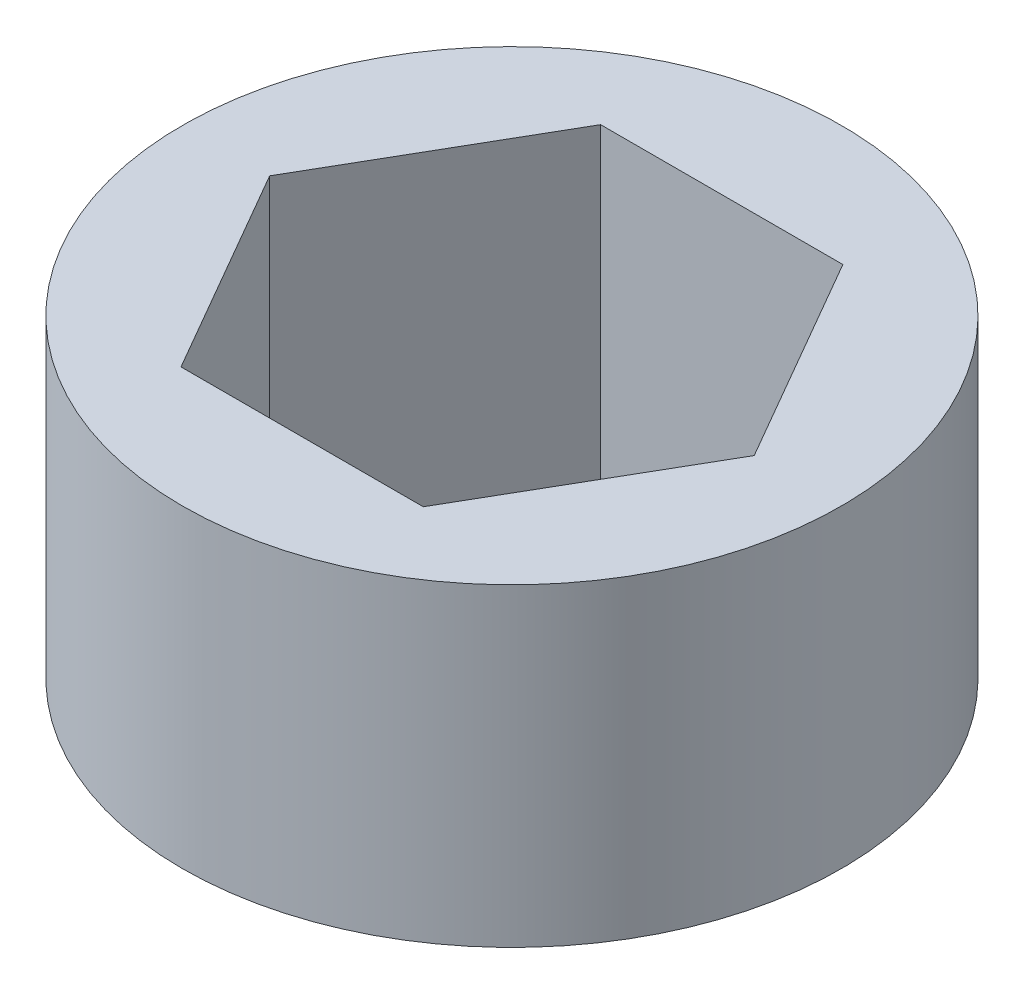
ISO-10303-21;
HEADER;
FILE_DESCRIPTION(('STEP AP214'),'2;1');
FILE_NAME('part.step','',(''),(''),'','','');
FILE_SCHEMA(('AUTOMOTIVE_DESIGN { 1 0 10303 214 1 1 1 1 }'));
ENDSEC;
DATA;
#1=APPLICATION_CONTEXT('core data for automotive mechanical design processes');
#2=APPLICATION_PROTOCOL_DEFINITION('international standard','automotive_design',2000,#1);
#3=PRODUCT_CONTEXT('',#1,'mechanical');
#4=PRODUCT('Part','Part','',(#3));
#5=PRODUCT_RELATED_PRODUCT_CATEGORY('part','',(#4));
#6=PRODUCT_DEFINITION_FORMATION('','',#4);
#7=PRODUCT_DEFINITION_CONTEXT('part definition',#1,'design');
#8=PRODUCT_DEFINITION('design','',#6,#7);
#9=PRODUCT_DEFINITION_SHAPE('','',#8);
#10=(LENGTH_UNIT() NAMED_UNIT(*) SI_UNIT(.MILLI.,.METRE.));
#11=(NAMED_UNIT(*) PLANE_ANGLE_UNIT() SI_UNIT($,.RADIAN.));
#12=(NAMED_UNIT(*) SI_UNIT($,.STERADIAN.) SOLID_ANGLE_UNIT());
#13=UNCERTAINTY_MEASURE_WITH_UNIT(LENGTH_MEASURE(1.E-05),#10,'distance_accuracy_value','');
#14=(GEOMETRIC_REPRESENTATION_CONTEXT(3) GLOBAL_UNCERTAINTY_ASSIGNED_CONTEXT((#13)) GLOBAL_UNIT_ASSIGNED_CONTEXT((#10,
#11,#12)) REPRESENTATION_CONTEXT('',''));
#15=CARTESIAN_POINT('',(0.,0.,0.));
#16=DIRECTION('',(0.,0.,1.));
#17=DIRECTION('',(1.,0.,0.));
#18=AXIS2_PLACEMENT_3D('',#15,#16,#17);
#19=CARTESIAN_POINT('',(0.,9.525,0.));
#20=DIRECTION('',(0.,1.,0.));
#21=DIRECTION('',(0.,0.,1.));
#22=AXIS2_PLACEMENT_3D('',#19,#20,#21);
#23=PLANE('',#22);
#24=CARTESIAN_POINT('',(0.,9.525,0.));
#25=DIRECTION('',(0.,1.,0.));
#26=DIRECTION('',(0.,0.,1.));
#27=AXIS2_PLACEMENT_3D('',#24,#25,#26);
#28=CIRCLE('',#27,9.9949);
#29=CARTESIAN_POINT('',(0.,9.525,9.9949));
#30=VERTEX_POINT('',#29);
#31=EDGE_CURVE('E11',#30,#30,#28,.T.);
#32=ORIENTED_EDGE('',*,*,#31,.T.);
#33=EDGE_LOOP('',(#32));
#34=FACE_BOUND('',#33,.T.);
#35=DIRECTION('',(-0.5,0.,-0.866025403784438));
#36=VECTOR('',#35,1.);
#37=CARTESIAN_POINT('',(7.34701311554567,9.525,0.));
#38=LINE('',#37,#36);
#39=CARTESIAN_POINT('',(7.34701311554567,9.525,0.));
#40=VERTEX_POINT('',#39);
#41=CARTESIAN_POINT('',(3.67350655777283,9.525,-6.3627));
#42=VERTEX_POINT('',#41);
#43=EDGE_CURVE('E95',#40,#42,#38,.T.);
#44=ORIENTED_EDGE('',*,*,#43,.F.);
#45=DIRECTION('',(0.5,0.,-0.866025403784439));
#46=VECTOR('',#45,1.);
#47=CARTESIAN_POINT('',(3.67350655777284,9.525,6.3627));
#48=LINE('',#47,#46);
#49=CARTESIAN_POINT('',(3.67350655777284,9.525,6.3627));
#50=VERTEX_POINT('',#49);
#51=EDGE_CURVE('E87',#50,#40,#48,.T.);
#52=ORIENTED_EDGE('',*,*,#51,.F.);
#53=DIRECTION('',(1.,0.,0.));
#54=VECTOR('',#53,1.);
#55=CARTESIAN_POINT('',(-3.67350655777283,9.525,6.3627));
#56=LINE('',#55,#54);
#57=CARTESIAN_POINT('',(-3.67350655777283,9.525,6.3627));
#58=VERTEX_POINT('',#57);
#59=EDGE_CURVE('E115',#58,#50,#56,.T.);
#60=ORIENTED_EDGE('',*,*,#59,.F.);
#61=DIRECTION('',(0.5,0.,0.866025403784438));
#62=VECTOR('',#61,1.);
#63=CARTESIAN_POINT('',(-7.34701311554566,9.525,0.));
#64=LINE('',#63,#62);
#65=CARTESIAN_POINT('',(-7.34701311554566,9.525,0.));
#66=VERTEX_POINT('',#65);
#67=EDGE_CURVE('E113',#66,#58,#64,.T.);
#68=ORIENTED_EDGE('',*,*,#67,.F.);
#69=DIRECTION('',(-0.5,0.,0.866025403784439));
#70=VECTOR('',#69,1.);
#71=CARTESIAN_POINT('',(-3.67350655777283,9.525,-6.3627));
#72=LINE('',#71,#70);
#73=CARTESIAN_POINT('',(-3.67350655777283,9.525,-6.3627));
#74=VERTEX_POINT('',#73);
#75=EDGE_CURVE('E109',#74,#66,#72,.T.);
#76=ORIENTED_EDGE('',*,*,#75,.F.);
#77=DIRECTION('',(-1.,0.,0.));
#78=VECTOR('',#77,1.);
#79=CARTESIAN_POINT('',(3.67350655777283,9.525,-6.3627));
#80=LINE('',#79,#78);
#81=EDGE_CURVE('E107',#42,#74,#80,.T.);
#82=ORIENTED_EDGE('',*,*,#81,.F.);
#83=EDGE_LOOP('',(#44,#52,#60,#68,#76,#82));
#84=FACE_BOUND('',#83,.T.);
#85=ADVANCED_FACE('F34',(#34,#84),#23,.T.);
#86=CARTESIAN_POINT('',(0.,0.,0.));
#87=DIRECTION('',(0.,1.,0.));
#88=DIRECTION('',(0.,0.,1.));
#89=AXIS2_PLACEMENT_3D('',#86,#87,#88);
#90=PLANE('',#89);
#91=CARTESIAN_POINT('',(0.,0.,0.));
#92=DIRECTION('',(0.,1.,0.));
#93=DIRECTION('',(0.,0.,1.));
#94=AXIS2_PLACEMENT_3D('',#91,#92,#93);
#95=CIRCLE('',#94,9.9949);
#96=CARTESIAN_POINT('',(0.,0.,9.9949));
#97=VERTEX_POINT('',#96);
#98=EDGE_CURVE('E38',#97,#97,#95,.T.);
#99=ORIENTED_EDGE('',*,*,#98,.F.);
#100=EDGE_LOOP('',(#99));
#101=FACE_BOUND('',#100,.T.);
#102=DIRECTION('',(0.5,0.,-0.866025403784439));
#103=VECTOR('',#102,1.);
#104=CARTESIAN_POINT('',(3.67350655777284,0.,6.3627));
#105=LINE('',#104,#103);
#106=CARTESIAN_POINT('',(3.67350655777284,0.,6.3627));
#107=VERTEX_POINT('',#106);
#108=CARTESIAN_POINT('',(7.34701311554567,0.,0.));
#109=VERTEX_POINT('',#108);
#110=EDGE_CURVE('E57',#107,#109,#105,.T.);
#111=ORIENTED_EDGE('',*,*,#110,.T.);
#112=DIRECTION('',(-0.5,0.,-0.866025403784438));
#113=VECTOR('',#112,1.);
#114=CARTESIAN_POINT('',(7.34701311554567,0.,0.));
#115=LINE('',#114,#113);
#116=CARTESIAN_POINT('',(3.67350655777283,0.,-6.3627));
#117=VERTEX_POINT('',#116);
#118=EDGE_CURVE('E102',#109,#117,#115,.T.);
#119=ORIENTED_EDGE('',*,*,#118,.T.);
#120=DIRECTION('',(-1.,0.,0.));
#121=VECTOR('',#120,1.);
#122=CARTESIAN_POINT('',(3.67350655777283,0.,-6.3627));
#123=LINE('',#122,#121);
#124=CARTESIAN_POINT('',(-3.67350655777283,0.,-6.3627));
#125=VERTEX_POINT('',#124);
#126=EDGE_CURVE('E119',#117,#125,#123,.T.);
#127=ORIENTED_EDGE('',*,*,#126,.T.);
#128=DIRECTION('',(-0.5,0.,0.866025403784439));
#129=VECTOR('',#128,1.);
#130=CARTESIAN_POINT('',(-3.67350655777283,0.,-6.3627));
#131=LINE('',#130,#129);
#132=CARTESIAN_POINT('',(-7.34701311554566,0.,0.));
#133=VERTEX_POINT('',#132);
#134=EDGE_CURVE('E122',#125,#133,#131,.T.);
#135=ORIENTED_EDGE('',*,*,#134,.T.);
#136=DIRECTION('',(0.5,0.,0.866025403784438));
#137=VECTOR('',#136,1.);
#138=CARTESIAN_POINT('',(-7.34701311554566,0.,0.));
#139=LINE('',#138,#137);
#140=CARTESIAN_POINT('',(-3.67350655777283,0.,6.3627));
#141=VERTEX_POINT('',#140);
#142=EDGE_CURVE('E125',#133,#141,#139,.T.);
#143=ORIENTED_EDGE('',*,*,#142,.T.);
#144=DIRECTION('',(1.,0.,0.));
#145=VECTOR('',#144,1.);
#146=CARTESIAN_POINT('',(-3.67350655777283,0.,6.3627));
#147=LINE('',#146,#145);
#148=EDGE_CURVE('E96',#141,#107,#147,.T.);
#149=ORIENTED_EDGE('',*,*,#148,.T.);
#150=EDGE_LOOP('',(#111,#119,#127,#135,#143,#149));
#151=FACE_BOUND('',#150,.T.);
#152=ADVANCED_FACE('F142',(#101,#151),#90,.F.);
#153=CARTESIAN_POINT('',(0.,9.525,0.));
#154=DIRECTION('',(0.,-1.,0.));
#155=DIRECTION('',(0.,0.,-1.));
#156=AXIS2_PLACEMENT_3D('',#153,#154,#155);
#157=CYLINDRICAL_SURFACE('',#156,9.9949);
#158=ORIENTED_EDGE('',*,*,#31,.F.);
#159=EDGE_LOOP('',(#158));
#160=FACE_BOUND('',#159,.T.);
#161=ORIENTED_EDGE('',*,*,#98,.T.);
#162=EDGE_LOOP('',(#161));
#163=FACE_BOUND('',#162,.T.);
#164=ADVANCED_FACE('F36',(#160,#163),#157,.T.);
#165=CARTESIAN_POINT('',(3.67350655777284,9.525,6.3627));
#166=DIRECTION('',(-0.866025403784439,0.,-0.5));
#167=DIRECTION('',(-0.5,0.,0.866025403784439));
#168=AXIS2_PLACEMENT_3D('',#165,#166,#167);
#169=PLANE('',#168);
#170=ORIENTED_EDGE('',*,*,#110,.F.);
#171=DIRECTION('',(0.,-1.,0.));
#172=VECTOR('',#171,1.);
#173=CARTESIAN_POINT('',(3.67350655777284,9.525,6.3627));
#174=LINE('',#173,#172);
#175=EDGE_CURVE('E91',#50,#107,#174,.T.);
#176=ORIENTED_EDGE('',*,*,#175,.F.);
#177=ORIENTED_EDGE('',*,*,#51,.T.);
#178=DIRECTION('',(0.,-1.,0.));
#179=VECTOR('',#178,1.);
#180=CARTESIAN_POINT('',(7.34701311554567,9.525,0.));
#181=LINE('',#180,#179);
#182=EDGE_CURVE('E90',#40,#109,#181,.T.);
#183=ORIENTED_EDGE('',*,*,#182,.T.);
#184=EDGE_LOOP('',(#170,#176,#177,#183));
#185=FACE_BOUND('',#184,.T.);
#186=ADVANCED_FACE('F89',(#185),#169,.T.);
#187=CARTESIAN_POINT('',(7.34701311554567,9.525,0.));
#188=DIRECTION('',(-0.866025403784438,0.,0.5));
#189=DIRECTION('',(0.5,0.,0.866025403784438));
#190=AXIS2_PLACEMENT_3D('',#187,#188,#189);
#191=PLANE('',#190);
#192=ORIENTED_EDGE('',*,*,#118,.F.);
#193=ORIENTED_EDGE('',*,*,#182,.F.);
#194=ORIENTED_EDGE('',*,*,#43,.T.);
#195=DIRECTION('',(0.,-1.,0.));
#196=VECTOR('',#195,1.);
#197=CARTESIAN_POINT('',(3.67350655777283,9.525,-6.3627));
#198=LINE('',#197,#196);
#199=EDGE_CURVE('E103',#42,#117,#198,.T.);
#200=ORIENTED_EDGE('',*,*,#199,.T.);
#201=EDGE_LOOP('',(#192,#193,#194,#200));
#202=FACE_BOUND('',#201,.T.);
#203=ADVANCED_FACE('F99',(#202),#191,.T.);
#204=CARTESIAN_POINT('',(3.67350655777283,9.525,-6.3627));
#205=DIRECTION('',(0.,0.,1.));
#206=DIRECTION('',(1.,0.,0.));
#207=AXIS2_PLACEMENT_3D('',#204,#205,#206);
#208=PLANE('',#207);
#209=ORIENTED_EDGE('',*,*,#126,.F.);
#210=ORIENTED_EDGE('',*,*,#199,.F.);
#211=ORIENTED_EDGE('',*,*,#81,.T.);
#212=DIRECTION('',(0.,-1.,0.));
#213=VECTOR('',#212,1.);
#214=CARTESIAN_POINT('',(-3.67350655777283,9.525,-6.3627));
#215=LINE('',#214,#213);
#216=EDGE_CURVE('E134',#74,#125,#215,.T.);
#217=ORIENTED_EDGE('',*,*,#216,.T.);
#218=EDGE_LOOP('',(#209,#210,#211,#217));
#219=FACE_BOUND('',#218,.T.);
#220=ADVANCED_FACE('F138',(#219),#208,.T.);
#221=CARTESIAN_POINT('',(-3.67350655777283,9.525,-6.3627));
#222=DIRECTION('',(0.866025403784439,0.,0.5));
#223=DIRECTION('',(0.5,0.,-0.866025403784439));
#224=AXIS2_PLACEMENT_3D('',#221,#222,#223);
#225=PLANE('',#224);
#226=ORIENTED_EDGE('',*,*,#134,.F.);
#227=ORIENTED_EDGE('',*,*,#216,.F.);
#228=ORIENTED_EDGE('',*,*,#75,.T.);
#229=DIRECTION('',(0.,-1.,0.));
#230=VECTOR('',#229,1.);
#231=CARTESIAN_POINT('',(-7.34701311554566,9.525,0.));
#232=LINE('',#231,#230);
#233=EDGE_CURVE('E132',#66,#133,#232,.T.);
#234=ORIENTED_EDGE('',*,*,#233,.T.);
#235=EDGE_LOOP('',(#226,#227,#228,#234));
#236=FACE_BOUND('',#235,.T.);
#237=ADVANCED_FACE('F150',(#236),#225,.T.);
#238=CARTESIAN_POINT('',(-7.34701311554566,9.525,0.));
#239=DIRECTION('',(0.866025403784439,0.,-0.5));
#240=DIRECTION('',(-0.5,0.,-0.866025403784438));
#241=AXIS2_PLACEMENT_3D('',#238,#239,#240);
#242=PLANE('',#241);
#243=ORIENTED_EDGE('',*,*,#142,.F.);
#244=ORIENTED_EDGE('',*,*,#233,.F.);
#245=ORIENTED_EDGE('',*,*,#67,.T.);
#246=DIRECTION('',(0.,-1.,0.));
#247=VECTOR('',#246,1.);
#248=CARTESIAN_POINT('',(-3.67350655777283,9.525,6.3627));
#249=LINE('',#248,#247);
#250=EDGE_CURVE('E49',#58,#141,#249,.T.);
#251=ORIENTED_EDGE('',*,*,#250,.T.);
#252=EDGE_LOOP('',(#243,#244,#245,#251));
#253=FACE_BOUND('',#252,.T.);
#254=ADVANCED_FACE('F148',(#253),#242,.T.);
#255=CARTESIAN_POINT('',(-3.67350655777283,9.525,6.3627));
#256=DIRECTION('',(0.,0.,-1.));
#257=DIRECTION('',(-1.,0.,0.));
#258=AXIS2_PLACEMENT_3D('',#255,#256,#257);
#259=PLANE('',#258);
#260=ORIENTED_EDGE('',*,*,#148,.F.);
#261=ORIENTED_EDGE('',*,*,#250,.F.);
#262=ORIENTED_EDGE('',*,*,#59,.T.);
#263=ORIENTED_EDGE('',*,*,#175,.T.);
#264=EDGE_LOOP('',(#260,#261,#262,#263));
#265=FACE_BOUND('',#264,.T.);
#266=ADVANCED_FACE('F144',(#265),#259,.T.);
#267=CLOSED_SHELL('',(#85,#152,#164,#186,#203,#220,#237,#254,#266));
#268=MANIFOLD_SOLID_BREP('B2',#267);
#269=ADVANCED_BREP_SHAPE_REPRESENTATION('',(#18,#268),#14);
#270=SHAPE_DEFINITION_REPRESENTATION(#9,#269);
ENDSEC;
END-ISO-10303-21;
